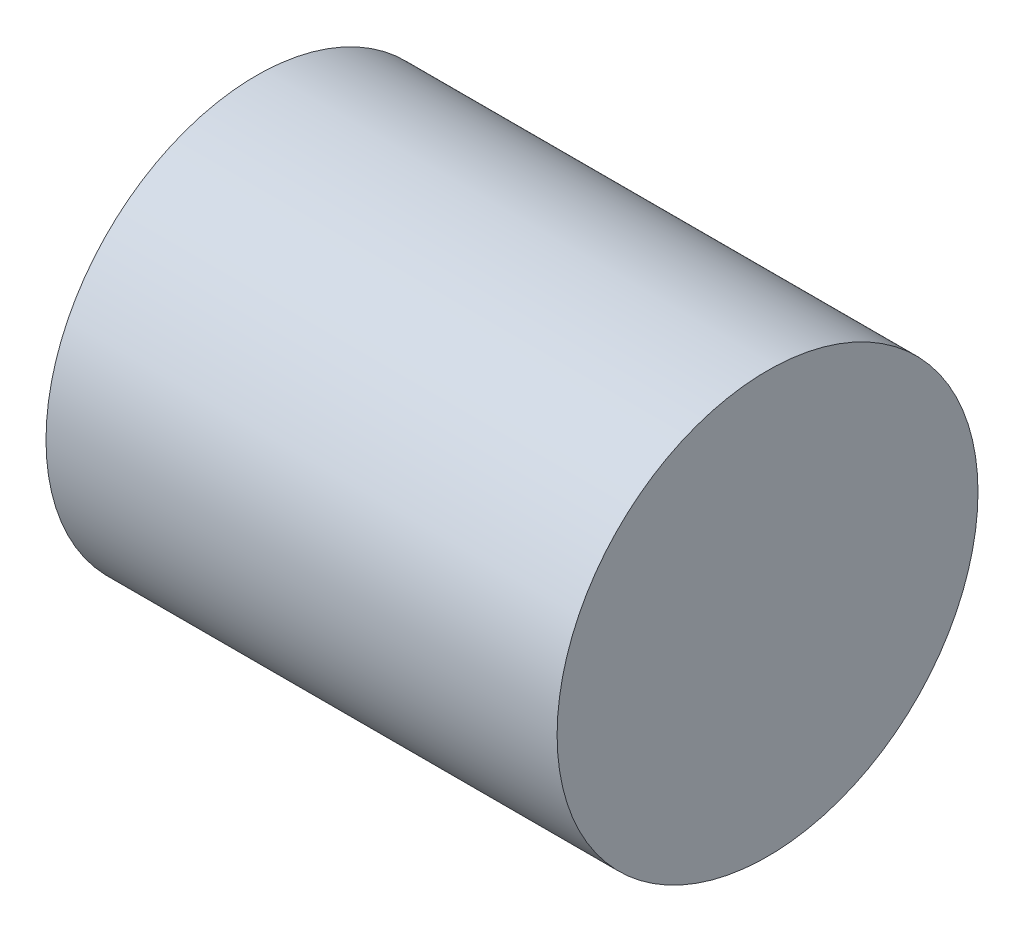
ISO-10303-21;
HEADER;
FILE_DESCRIPTION(('STEP AP214'),'2;1');
FILE_NAME('part.step','',(''),(''),'','','');
FILE_SCHEMA(('AUTOMOTIVE_DESIGN { 1 0 10303 214 1 1 1 1 }'));
ENDSEC;
DATA;
#1=APPLICATION_CONTEXT('core data for automotive mechanical design processes');
#2=APPLICATION_PROTOCOL_DEFINITION('international standard','automotive_design',2000,#1);
#3=PRODUCT_CONTEXT('',#1,'mechanical');
#4=PRODUCT('Part','Part','',(#3));
#5=PRODUCT_RELATED_PRODUCT_CATEGORY('part','',(#4));
#6=PRODUCT_DEFINITION_FORMATION('','',#4);
#7=PRODUCT_DEFINITION_CONTEXT('part definition',#1,'design');
#8=PRODUCT_DEFINITION('design','',#6,#7);
#9=PRODUCT_DEFINITION_SHAPE('','',#8);
#10=(LENGTH_UNIT() NAMED_UNIT(*) SI_UNIT(.MILLI.,.METRE.));
#11=(NAMED_UNIT(*) PLANE_ANGLE_UNIT() SI_UNIT($,.RADIAN.));
#12=(NAMED_UNIT(*) SI_UNIT($,.STERADIAN.) SOLID_ANGLE_UNIT());
#13=UNCERTAINTY_MEASURE_WITH_UNIT(LENGTH_MEASURE(1.E-05),#10,'distance_accuracy_value','');
#14=(GEOMETRIC_REPRESENTATION_CONTEXT(3) GLOBAL_UNCERTAINTY_ASSIGNED_CONTEXT((#13)) GLOBAL_UNIT_ASSIGNED_CONTEXT((#10,
#11,#12)) REPRESENTATION_CONTEXT('',''));
#15=CARTESIAN_POINT('',(0.,0.,0.));
#16=DIRECTION('',(0.,0.,1.));
#17=DIRECTION('',(1.,0.,0.));
#18=AXIS2_PLACEMENT_3D('',#15,#16,#17);
#19=CARTESIAN_POINT('',(0.,0.,0.));
#20=DIRECTION('',(-1.,0.,0.));
#21=DIRECTION('',(0.,0.,1.));
#22=AXIS2_PLACEMENT_3D('',#19,#20,#21);
#23=PLANE('',#22);
#24=CARTESIAN_POINT('',(0.,0.,0.));
#25=DIRECTION('',(1.,0.,0.));
#26=DIRECTION('',(0.,0.,-1.));
#27=AXIS2_PLACEMENT_3D('',#24,#25,#26);
#28=CIRCLE('',#27,14.);
#29=CARTESIAN_POINT('',(0.,0.,-14.));
#30=VERTEX_POINT('',#29);
#31=EDGE_CURVE('E16',#30,#30,#28,.T.);
#32=ORIENTED_EDGE('',*,*,#31,.F.);
#33=EDGE_LOOP('',(#32));
#34=FACE_BOUND('',#33,.T.);
#35=ADVANCED_FACE('F13',(#34),#23,.T.);
#36=CARTESIAN_POINT('',(34.,0.,0.));
#37=DIRECTION('',(1.,0.,0.));
#38=DIRECTION('',(0.,1.,0.));
#39=AXIS2_PLACEMENT_3D('',#36,#37,#38);
#40=PLANE('',#39);
#41=CARTESIAN_POINT('',(34.,0.,0.));
#42=DIRECTION('',(1.,0.,0.));
#43=DIRECTION('',(0.,0.,-1.));
#44=AXIS2_PLACEMENT_3D('',#41,#42,#43);
#45=CIRCLE('',#44,14.);
#46=CARTESIAN_POINT('',(34.,0.,-14.));
#47=VERTEX_POINT('',#46);
#48=EDGE_CURVE('E9',#47,#47,#45,.F.);
#49=ORIENTED_EDGE('',*,*,#48,.F.);
#50=EDGE_LOOP('',(#49));
#51=FACE_BOUND('',#50,.T.);
#52=ADVANCED_FACE('F28',(#51),#40,.T.);
#53=CARTESIAN_POINT('',(17.,0.,0.));
#54=DIRECTION('',(1.,0.,0.));
#55=DIRECTION('',(0.,0.,-1.));
#56=AXIS2_PLACEMENT_3D('',#53,#54,#55);
#57=CYLINDRICAL_SURFACE('',#56,14.);
#58=ORIENTED_EDGE('',*,*,#31,.T.);
#59=EDGE_LOOP('',(#58));
#60=FACE_BOUND('',#59,.T.);
#61=ORIENTED_EDGE('',*,*,#48,.T.);
#62=EDGE_LOOP('',(#61));
#63=FACE_BOUND('',#62,.T.);
#64=ADVANCED_FACE('F25',(#60,#63),#57,.T.);
#65=CLOSED_SHELL('',(#35,#52,#64));
#66=MANIFOLD_SOLID_BREP('B1',#65);
#67=ADVANCED_BREP_SHAPE_REPRESENTATION('',(#18,#66),#14);
#68=SHAPE_DEFINITION_REPRESENTATION(#9,#67);
ENDSEC;
END-ISO-10303-21;
